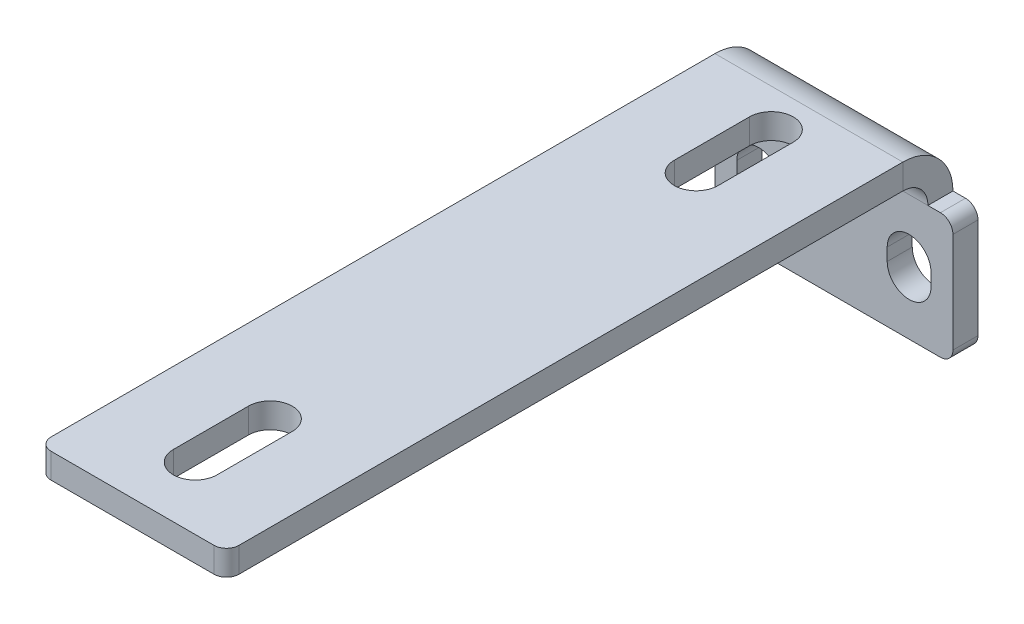
ISO-10303-21;
HEADER;
FILE_DESCRIPTION(('STEP AP214'),'2;1');
FILE_NAME('part.step','',(''),(''),'','','');
FILE_SCHEMA(('AUTOMOTIVE_DESIGN { 1 0 10303 214 1 1 1 1 }'));
ENDSEC;
DATA;
#1=APPLICATION_CONTEXT('core data for automotive mechanical design processes');
#2=APPLICATION_PROTOCOL_DEFINITION('international standard','automotive_design',2000,#1);
#3=PRODUCT_CONTEXT('',#1,'mechanical');
#4=PRODUCT('Part','Part','',(#3));
#5=PRODUCT_RELATED_PRODUCT_CATEGORY('part','',(#4));
#6=PRODUCT_DEFINITION_FORMATION('','',#4);
#7=PRODUCT_DEFINITION_CONTEXT('part definition',#1,'design');
#8=PRODUCT_DEFINITION('design','',#6,#7);
#9=PRODUCT_DEFINITION_SHAPE('','',#8);
#10=(LENGTH_UNIT() NAMED_UNIT(*) SI_UNIT(.MILLI.,.METRE.));
#11=(NAMED_UNIT(*) PLANE_ANGLE_UNIT() SI_UNIT($,.RADIAN.));
#12=(NAMED_UNIT(*) SI_UNIT($,.STERADIAN.) SOLID_ANGLE_UNIT());
#13=UNCERTAINTY_MEASURE_WITH_UNIT(LENGTH_MEASURE(1.E-05),#10,'distance_accuracy_value','');
#14=(GEOMETRIC_REPRESENTATION_CONTEXT(3) GLOBAL_UNCERTAINTY_ASSIGNED_CONTEXT((#13)) GLOBAL_UNIT_ASSIGNED_CONTEXT((#10,
#11,#12)) REPRESENTATION_CONTEXT('',''));
#15=CARTESIAN_POINT('',(0.,0.,0.));
#16=DIRECTION('',(0.,0.,1.));
#17=DIRECTION('',(1.,0.,0.));
#18=AXIS2_PLACEMENT_3D('',#15,#16,#17);
#19=CARTESIAN_POINT('',(0.,0.,-2.));
#20=DIRECTION('',(0.,1.,0.));
#21=DIRECTION('',(-1.,0.,0.));
#22=AXIS2_PLACEMENT_3D('',#19,#20,#21);
#23=PLANE('',#22);
#24=DIRECTION('',(-1.,0.,0.));
#25=VECTOR('',#24,1.);
#26=CARTESIAN_POINT('',(0.,0.,-2.));
#27=LINE('',#26,#25);
#28=CARTESIAN_POINT('',(2.,0.,-2.));
#29=VERTEX_POINT('',#28);
#30=CARTESIAN_POINT('',(1.,0.,-2.));
#31=VERTEX_POINT('',#30);
#32=EDGE_CURVE('E466',#29,#31,#27,.T.);
#33=ORIENTED_EDGE('',*,*,#32,.T.);
#34=DIRECTION('',(0.,0.,1.));
#35=VECTOR('',#34,1.);
#36=CARTESIAN_POINT('',(1.,0.,-2.));
#37=LINE('',#36,#35);
#38=CARTESIAN_POINT('',(1.,0.,0.));
#39=VERTEX_POINT('',#38);
#40=EDGE_CURVE('E469',#31,#39,#37,.T.);
#41=ORIENTED_EDGE('',*,*,#40,.T.);
#42=DIRECTION('',(-1.,0.,0.));
#43=VECTOR('',#42,1.);
#44=CARTESIAN_POINT('',(0.,0.,0.));
#45=LINE('',#44,#43);
#46=CARTESIAN_POINT('',(2.,0.,0.));
#47=VERTEX_POINT('',#46);
#48=EDGE_CURVE('E478',#47,#39,#45,.T.);
#49=ORIENTED_EDGE('',*,*,#48,.F.);
#50=DIRECTION('',(0.,0.,-1.));
#51=VECTOR('',#50,1.);
#52=CARTESIAN_POINT('',(2.,0.,0.));
#53=LINE('',#52,#51);
#54=EDGE_CURVE('E376',#47,#29,#53,.T.);
#55=ORIENTED_EDGE('',*,*,#54,.T.);
#56=EDGE_LOOP('',(#33,#41,#49,#55));
#57=FACE_BOUND('',#56,.T.);
#58=ADVANCED_FACE('F58',(#57),#23,.T.);
#59=CARTESIAN_POINT('',(0.,0.,-2.));
#60=DIRECTION('',(-1.,0.,0.));
#61=DIRECTION('',(0.,0.,1.));
#62=AXIS2_PLACEMENT_3D('',#59,#60,#61);
#63=PLANE('',#62);
#64=DIRECTION('',(0.,-1.,0.));
#65=VECTOR('',#64,1.);
#66=CARTESIAN_POINT('',(0.,0.,0.));
#67=LINE('',#66,#65);
#68=CARTESIAN_POINT('',(0.,-1.,0.));
#69=VERTEX_POINT('',#68);
#70=CARTESIAN_POINT('',(0.,-9.,0.));
#71=VERTEX_POINT('',#70);
#72=EDGE_CURVE('E449',#69,#71,#67,.T.);
#73=ORIENTED_EDGE('',*,*,#72,.F.);
#74=DIRECTION('',(0.,0.,1.));
#75=VECTOR('',#74,1.);
#76=CARTESIAN_POINT('',(0.,-1.,-2.));
#77=LINE('',#76,#75);
#78=CARTESIAN_POINT('',(0.,-1.,-2.));
#79=VERTEX_POINT('',#78);
#80=EDGE_CURVE('E493',#69,#79,#77,.F.);
#81=ORIENTED_EDGE('',*,*,#80,.T.);
#82=DIRECTION('',(0.,-1.,0.));
#83=VECTOR('',#82,1.);
#84=CARTESIAN_POINT('',(0.,0.,-2.));
#85=LINE('',#84,#83);
#86=CARTESIAN_POINT('',(0.,-9.,-2.));
#87=VERTEX_POINT('',#86);
#88=EDGE_CURVE('E456',#79,#87,#85,.T.);
#89=ORIENTED_EDGE('',*,*,#88,.T.);
#90=DIRECTION('',(0.,0.,1.));
#91=VECTOR('',#90,1.);
#92=CARTESIAN_POINT('',(0.,-9.,-2.));
#93=LINE('',#92,#91);
#94=EDGE_CURVE('E490',#87,#71,#93,.T.);
#95=ORIENTED_EDGE('',*,*,#94,.T.);
#96=EDGE_LOOP('',(#73,#81,#89,#95));
#97=FACE_BOUND('',#96,.T.);
#98=ADVANCED_FACE('F541',(#97),#63,.T.);
#99=CARTESIAN_POINT('',(18.,0.,0.));
#100=VERTEX_POINT('',#99);
#101=CARTESIAN_POINT('',(17.,0.,0.));
#102=VERTEX_POINT('',#101);
#103=EDGE_CURVE('E460',#100,#102,#45,.T.);
#104=ORIENTED_EDGE('',*,*,#103,.F.);
#105=DIRECTION('',(0.,0.,1.));
#106=VECTOR('',#105,1.);
#107=CARTESIAN_POINT('',(18.,0.,-2.));
#108=LINE('',#107,#106);
#109=CARTESIAN_POINT('',(18.,0.,-2.));
#110=VERTEX_POINT('',#109);
#111=EDGE_CURVE('E508',#100,#110,#108,.F.);
#112=ORIENTED_EDGE('',*,*,#111,.T.);
#113=CARTESIAN_POINT('',(17.,0.,-2.));
#114=VERTEX_POINT('',#113);
#115=EDGE_CURVE('E467',#110,#114,#27,.T.);
#116=ORIENTED_EDGE('',*,*,#115,.T.);
#117=DIRECTION('',(0.,0.,-1.));
#118=VECTOR('',#117,1.);
#119=CARTESIAN_POINT('',(17.,0.,0.));
#120=LINE('',#119,#118);
#121=EDGE_CURVE('E386',#102,#114,#120,.T.);
#122=ORIENTED_EDGE('',*,*,#121,.F.);
#123=EDGE_LOOP('',(#104,#112,#116,#122));
#124=FACE_BOUND('',#123,.T.);
#125=ADVANCED_FACE('F605',(#124),#23,.T.);
#126=CARTESIAN_POINT('',(19.,0.,-2.));
#127=DIRECTION('',(1.,0.,0.));
#128=DIRECTION('',(0.,0.,-1.));
#129=AXIS2_PLACEMENT_3D('',#126,#127,#128);
#130=PLANE('',#129);
#131=DIRECTION('',(0.,1.,0.));
#132=VECTOR('',#131,1.);
#133=CARTESIAN_POINT('',(19.,0.,-2.));
#134=LINE('',#133,#132);
#135=CARTESIAN_POINT('',(19.,-9.,-2.));
#136=VERTEX_POINT('',#135);
#137=CARTESIAN_POINT('',(19.,-1.,-2.));
#138=VERTEX_POINT('',#137);
#139=EDGE_CURVE('E463',#136,#138,#134,.T.);
#140=ORIENTED_EDGE('',*,*,#139,.T.);
#141=DIRECTION('',(0.,0.,1.));
#142=VECTOR('',#141,1.);
#143=CARTESIAN_POINT('',(19.,-1.,-2.));
#144=LINE('',#143,#142);
#145=CARTESIAN_POINT('',(19.,-1.,0.));
#146=VERTEX_POINT('',#145);
#147=EDGE_CURVE('E505',#138,#146,#144,.T.);
#148=ORIENTED_EDGE('',*,*,#147,.T.);
#149=DIRECTION('',(0.,1.,0.));
#150=VECTOR('',#149,1.);
#151=CARTESIAN_POINT('',(19.,0.,0.));
#152=LINE('',#151,#150);
#153=CARTESIAN_POINT('',(19.,-9.,0.));
#154=VERTEX_POINT('',#153);
#155=EDGE_CURVE('E475',#154,#146,#152,.T.);
#156=ORIENTED_EDGE('',*,*,#155,.F.);
#157=DIRECTION('',(0.,0.,1.));
#158=VECTOR('',#157,1.);
#159=CARTESIAN_POINT('',(19.,-9.,-2.));
#160=LINE('',#159,#158);
#161=EDGE_CURVE('E503',#154,#136,#160,.F.);
#162=ORIENTED_EDGE('',*,*,#161,.T.);
#163=EDGE_LOOP('',(#140,#148,#156,#162));
#164=FACE_BOUND('',#163,.T.);
#165=ADVANCED_FACE('F613',(#164),#130,.T.);
#166=CARTESIAN_POINT('',(0.,-10.,-2.));
#167=DIRECTION('',(0.,-1.,0.));
#168=DIRECTION('',(1.,0.,0.));
#169=AXIS2_PLACEMENT_3D('',#166,#167,#168);
#170=PLANE('',#169);
#171=DIRECTION('',(1.,0.,0.));
#172=VECTOR('',#171,1.);
#173=CARTESIAN_POINT('',(0.,-10.,-2.));
#174=LINE('',#173,#172);
#175=CARTESIAN_POINT('',(1.,-10.,-2.));
#176=VERTEX_POINT('',#175);
#177=CARTESIAN_POINT('',(18.,-10.,-2.));
#178=VERTEX_POINT('',#177);
#179=EDGE_CURVE('E459',#176,#178,#174,.T.);
#180=ORIENTED_EDGE('',*,*,#179,.T.);
#181=DIRECTION('',(0.,0.,1.));
#182=VECTOR('',#181,1.);
#183=CARTESIAN_POINT('',(18.,-10.,-2.));
#184=LINE('',#183,#182);
#185=CARTESIAN_POINT('',(18.,-10.,0.));
#186=VERTEX_POINT('',#185);
#187=EDGE_CURVE('E13',#178,#186,#184,.T.);
#188=ORIENTED_EDGE('',*,*,#187,.T.);
#189=DIRECTION('',(1.,0.,0.));
#190=VECTOR('',#189,1.);
#191=CARTESIAN_POINT('',(0.,-10.,0.));
#192=LINE('',#191,#190);
#193=CARTESIAN_POINT('',(1.,-10.,0.));
#194=VERTEX_POINT('',#193);
#195=EDGE_CURVE('E472',#194,#186,#192,.T.);
#196=ORIENTED_EDGE('',*,*,#195,.F.);
#197=DIRECTION('',(0.,0.,1.));
#198=VECTOR('',#197,1.);
#199=CARTESIAN_POINT('',(1.,-10.,-2.));
#200=LINE('',#199,#198);
#201=EDGE_CURVE('E66',#194,#176,#200,.F.);
#202=ORIENTED_EDGE('',*,*,#201,.T.);
#203=EDGE_LOOP('',(#180,#188,#196,#202));
#204=FACE_BOUND('',#203,.T.);
#205=ADVANCED_FACE('F529',(#204),#170,.T.);
#206=CARTESIAN_POINT('',(0.,0.,-2.));
#207=DIRECTION('',(0.,0.,1.));
#208=DIRECTION('',(1.,0.,0.));
#209=AXIS2_PLACEMENT_3D('',#206,#207,#208);
#210=PLANE('',#209);
#211=DIRECTION('',(0.,1.,0.));
#212=VECTOR('',#211,1.);
#213=CARTESIAN_POINT('',(17.25,-4.5,-2.));
#214=LINE('',#213,#212);
#215=CARTESIAN_POINT('',(17.25,-5.5,-2.));
#216=VERTEX_POINT('',#215);
#217=CARTESIAN_POINT('',(17.25,-4.5,-2.));
#218=VERTEX_POINT('',#217);
#219=EDGE_CURVE('E402',#216,#218,#214,.T.);
#220=ORIENTED_EDGE('',*,*,#219,.T.);
#221=CARTESIAN_POINT('',(15.5,-4.5,-2.));
#222=DIRECTION('',(0.,0.,1.));
#223=DIRECTION('',(1.,0.,0.));
#224=AXIS2_PLACEMENT_3D('',#221,#222,#223);
#225=CIRCLE('',#224,1.75);
#226=CARTESIAN_POINT('',(13.75,-4.5,-2.));
#227=VERTEX_POINT('',#226);
#228=EDGE_CURVE('E392',#218,#227,#225,.T.);
#229=ORIENTED_EDGE('',*,*,#228,.T.);
#230=DIRECTION('',(0.,-1.,0.));
#231=VECTOR('',#230,1.);
#232=CARTESIAN_POINT('',(13.75,-4.5,-2.));
#233=LINE('',#232,#231);
#234=CARTESIAN_POINT('',(13.75,-5.5,-2.));
#235=VERTEX_POINT('',#234);
#236=EDGE_CURVE('E395',#227,#235,#233,.T.);
#237=ORIENTED_EDGE('',*,*,#236,.T.);
#238=CARTESIAN_POINT('',(15.5,-5.5,-2.));
#239=DIRECTION('',(0.,0.,1.));
#240=DIRECTION('',(1.,0.,0.));
#241=AXIS2_PLACEMENT_3D('',#238,#239,#240);
#242=CIRCLE('',#241,1.75);
#243=EDGE_CURVE('E399',#235,#216,#242,.T.);
#244=ORIENTED_EDGE('',*,*,#243,.T.);
#245=EDGE_LOOP('',(#220,#229,#237,#244));
#246=FACE_BOUND('',#245,.T.);
#247=DIRECTION('',(0.,1.,0.));
#248=VECTOR('',#247,1.);
#249=CARTESIAN_POINT('',(5.25,-4.5,-2.));
#250=LINE('',#249,#248);
#251=CARTESIAN_POINT('',(5.25,-5.5,-2.));
#252=VERTEX_POINT('',#251);
#253=CARTESIAN_POINT('',(5.25,-4.5,-2.));
#254=VERTEX_POINT('',#253);
#255=EDGE_CURVE('E434',#252,#254,#250,.T.);
#256=ORIENTED_EDGE('',*,*,#255,.T.);
#257=CARTESIAN_POINT('',(3.5,-4.5,-2.));
#258=DIRECTION('',(0.,0.,1.));
#259=DIRECTION('',(1.,0.,0.));
#260=AXIS2_PLACEMENT_3D('',#257,#258,#259);
#261=CIRCLE('',#260,1.75);
#262=CARTESIAN_POINT('',(1.75,-4.5,-2.));
#263=VERTEX_POINT('',#262);
#264=EDGE_CURVE('E424',#254,#263,#261,.T.);
#265=ORIENTED_EDGE('',*,*,#264,.T.);
#266=DIRECTION('',(0.,-1.,0.));
#267=VECTOR('',#266,1.);
#268=CARTESIAN_POINT('',(1.75,-4.5,-2.));
#269=LINE('',#268,#267);
#270=CARTESIAN_POINT('',(1.75,-5.5,-2.));
#271=VERTEX_POINT('',#270);
#272=EDGE_CURVE('E427',#263,#271,#269,.T.);
#273=ORIENTED_EDGE('',*,*,#272,.T.);
#274=CARTESIAN_POINT('',(3.5,-5.5,-2.));
#275=DIRECTION('',(0.,0.,1.));
#276=DIRECTION('',(1.,0.,0.));
#277=AXIS2_PLACEMENT_3D('',#274,#275,#276);
#278=CIRCLE('',#277,1.75);
#279=EDGE_CURVE('E431',#271,#252,#278,.T.);
#280=ORIENTED_EDGE('',*,*,#279,.T.);
#281=EDGE_LOOP('',(#256,#265,#273,#280));
#282=FACE_BOUND('',#281,.T.);
#283=ORIENTED_EDGE('',*,*,#88,.F.);
#284=CARTESIAN_POINT('',(1.,-1.,-2.));
#285=DIRECTION('',(0.,0.,1.));
#286=DIRECTION('',(1.,0.,0.));
#287=AXIS2_PLACEMENT_3D('',#284,#285,#286);
#288=CIRCLE('',#287,1.);
#289=EDGE_CURVE('E501',#79,#31,#288,.F.);
#290=ORIENTED_EDGE('',*,*,#289,.T.);
#291=ORIENTED_EDGE('',*,*,#32,.F.);
#292=DIRECTION('',(-1.,0.,0.));
#293=VECTOR('',#292,1.);
#294=CARTESIAN_POINT('',(2.,0.,-2.));
#295=LINE('',#294,#293);
#296=EDGE_CURVE('E369',#29,#114,#295,.F.);
#297=ORIENTED_EDGE('',*,*,#296,.T.);
#298=ORIENTED_EDGE('',*,*,#115,.F.);
#299=CARTESIAN_POINT('',(18.,-1.,-2.));
#300=DIRECTION('',(0.,0.,1.));
#301=DIRECTION('',(1.,0.,0.));
#302=AXIS2_PLACEMENT_3D('',#299,#300,#301);
#303=CIRCLE('',#302,1.);
#304=EDGE_CURVE('E499',#110,#138,#303,.F.);
#305=ORIENTED_EDGE('',*,*,#304,.T.);
#306=ORIENTED_EDGE('',*,*,#139,.F.);
#307=CARTESIAN_POINT('',(18.,-9.,-2.));
#308=DIRECTION('',(0.,0.,1.));
#309=DIRECTION('',(1.,0.,0.));
#310=AXIS2_PLACEMENT_3D('',#307,#308,#309);
#311=CIRCLE('',#310,1.);
#312=EDGE_CURVE('E497',#136,#178,#311,.F.);
#313=ORIENTED_EDGE('',*,*,#312,.T.);
#314=ORIENTED_EDGE('',*,*,#179,.F.);
#315=CARTESIAN_POINT('',(1.,-9.,-2.));
#316=DIRECTION('',(0.,0.,1.));
#317=DIRECTION('',(1.,0.,0.));
#318=AXIS2_PLACEMENT_3D('',#315,#316,#317);
#319=CIRCLE('',#318,1.);
#320=EDGE_CURVE('E495',#176,#87,#319,.F.);
#321=ORIENTED_EDGE('',*,*,#320,.T.);
#322=EDGE_LOOP('',(#283,#290,#291,#297,#298,#305,#306,#313,#314,#321));
#323=FACE_BOUND('',#322,.T.);
#324=ADVANCED_FACE('F535',(#246,#282,#323),#210,.F.);
#325=CARTESIAN_POINT('',(0.,0.,0.));
#326=DIRECTION('',(0.,0.,1.));
#327=DIRECTION('',(1.,0.,0.));
#328=AXIS2_PLACEMENT_3D('',#325,#326,#327);
#329=PLANE('',#328);
#330=CARTESIAN_POINT('',(15.5,-4.5,0.));
#331=DIRECTION('',(0.,0.,1.));
#332=DIRECTION('',(1.,0.,0.));
#333=AXIS2_PLACEMENT_3D('',#330,#331,#332);
#334=CIRCLE('',#333,1.75);
#335=CARTESIAN_POINT('',(17.25,-4.5,0.));
#336=VERTEX_POINT('',#335);
#337=CARTESIAN_POINT('',(13.75,-4.5,0.));
#338=VERTEX_POINT('',#337);
#339=EDGE_CURVE('E389',#336,#338,#334,.T.);
#340=ORIENTED_EDGE('',*,*,#339,.F.);
#341=DIRECTION('',(0.,1.,0.));
#342=VECTOR('',#341,1.);
#343=CARTESIAN_POINT('',(17.25,-4.5,0.));
#344=LINE('',#343,#342);
#345=CARTESIAN_POINT('',(17.25,-5.5,0.));
#346=VERTEX_POINT('',#345);
#347=EDGE_CURVE('E396',#346,#336,#344,.T.);
#348=ORIENTED_EDGE('',*,*,#347,.F.);
#349=CARTESIAN_POINT('',(15.5,-5.5,0.));
#350=DIRECTION('',(0.,0.,1.));
#351=DIRECTION('',(1.,0.,0.));
#352=AXIS2_PLACEMENT_3D('',#349,#350,#351);
#353=CIRCLE('',#352,1.75);
#354=CARTESIAN_POINT('',(13.75,-5.5,0.));
#355=VERTEX_POINT('',#354);
#356=EDGE_CURVE('E410',#355,#346,#353,.T.);
#357=ORIENTED_EDGE('',*,*,#356,.F.);
#358=DIRECTION('',(0.,-1.,0.));
#359=VECTOR('',#358,1.);
#360=CARTESIAN_POINT('',(13.75,-4.5,0.));
#361=LINE('',#360,#359);
#362=EDGE_CURVE('E407',#338,#355,#361,.T.);
#363=ORIENTED_EDGE('',*,*,#362,.F.);
#364=EDGE_LOOP('',(#340,#348,#357,#363));
#365=FACE_BOUND('',#364,.T.);
#366=CARTESIAN_POINT('',(3.5,-4.5,0.));
#367=DIRECTION('',(0.,0.,1.));
#368=DIRECTION('',(1.,0.,0.));
#369=AXIS2_PLACEMENT_3D('',#366,#367,#368);
#370=CIRCLE('',#369,1.75);
#371=CARTESIAN_POINT('',(5.25,-4.5,0.));
#372=VERTEX_POINT('',#371);
#373=CARTESIAN_POINT('',(1.75,-4.5,0.));
#374=VERTEX_POINT('',#373);
#375=EDGE_CURVE('E417',#372,#374,#370,.T.);
#376=ORIENTED_EDGE('',*,*,#375,.F.);
#377=DIRECTION('',(0.,1.,0.));
#378=VECTOR('',#377,1.);
#379=CARTESIAN_POINT('',(5.25,-4.5,0.));
#380=LINE('',#379,#378);
#381=CARTESIAN_POINT('',(5.25,-5.5,0.));
#382=VERTEX_POINT('',#381);
#383=EDGE_CURVE('E428',#382,#372,#380,.T.);
#384=ORIENTED_EDGE('',*,*,#383,.F.);
#385=CARTESIAN_POINT('',(3.5,-5.5,0.));
#386=DIRECTION('',(0.,0.,1.));
#387=DIRECTION('',(1.,0.,0.));
#388=AXIS2_PLACEMENT_3D('',#385,#386,#387);
#389=CIRCLE('',#388,1.75);
#390=CARTESIAN_POINT('',(1.75,-5.5,0.));
#391=VERTEX_POINT('',#390);
#392=EDGE_CURVE('E442',#391,#382,#389,.T.);
#393=ORIENTED_EDGE('',*,*,#392,.F.);
#394=DIRECTION('',(0.,-1.,0.));
#395=VECTOR('',#394,1.);
#396=CARTESIAN_POINT('',(1.75,-4.5,0.));
#397=LINE('',#396,#395);
#398=EDGE_CURVE('E439',#374,#391,#397,.T.);
#399=ORIENTED_EDGE('',*,*,#398,.F.);
#400=EDGE_LOOP('',(#376,#384,#393,#399));
#401=FACE_BOUND('',#400,.T.);
#402=ORIENTED_EDGE('',*,*,#48,.T.);
#403=CARTESIAN_POINT('',(1.,-1.,0.));
#404=DIRECTION('',(0.,0.,1.));
#405=DIRECTION('',(1.,0.,0.));
#406=AXIS2_PLACEMENT_3D('',#403,#404,#405);
#407=CIRCLE('',#406,1.);
#408=EDGE_CURVE('E488',#39,#69,#407,.T.);
#409=ORIENTED_EDGE('',*,*,#408,.T.);
#410=ORIENTED_EDGE('',*,*,#72,.T.);
#411=CARTESIAN_POINT('',(1.,-9.,0.));
#412=DIRECTION('',(0.,0.,1.));
#413=DIRECTION('',(1.,0.,0.));
#414=AXIS2_PLACEMENT_3D('',#411,#412,#413);
#415=CIRCLE('',#414,1.);
#416=EDGE_CURVE('E482',#71,#194,#415,.T.);
#417=ORIENTED_EDGE('',*,*,#416,.T.);
#418=ORIENTED_EDGE('',*,*,#195,.T.);
#419=CARTESIAN_POINT('',(18.,-9.,0.));
#420=DIRECTION('',(0.,0.,1.));
#421=DIRECTION('',(1.,0.,0.));
#422=AXIS2_PLACEMENT_3D('',#419,#420,#421);
#423=CIRCLE('',#422,1.);
#424=EDGE_CURVE('E484',#186,#154,#423,.T.);
#425=ORIENTED_EDGE('',*,*,#424,.T.);
#426=ORIENTED_EDGE('',*,*,#155,.T.);
#427=CARTESIAN_POINT('',(18.,-1.,0.));
#428=DIRECTION('',(0.,0.,1.));
#429=DIRECTION('',(1.,0.,0.));
#430=AXIS2_PLACEMENT_3D('',#427,#428,#429);
#431=CIRCLE('',#430,1.);
#432=EDGE_CURVE('E486',#146,#100,#431,.T.);
#433=ORIENTED_EDGE('',*,*,#432,.T.);
#434=ORIENTED_EDGE('',*,*,#103,.T.);
#435=DIRECTION('',(-1.,0.,0.));
#436=VECTOR('',#435,1.);
#437=CARTESIAN_POINT('',(2.,0.,0.));
#438=LINE('',#437,#436);
#439=EDGE_CURVE('E381',#47,#102,#438,.F.);
#440=ORIENTED_EDGE('',*,*,#439,.F.);
#441=EDGE_LOOP('',(#402,#409,#410,#417,#418,#425,#426,#433,#434,#440));
#442=FACE_BOUND('',#441,.T.);
#443=ADVANCED_FACE('F545',(#365,#401,#442),#329,.T.);
#444=CARTESIAN_POINT('',(3.5,-4.5,-2.));
#445=DIRECTION('',(0.,0.,1.));
#446=DIRECTION('',(1.,0.,0.));
#447=AXIS2_PLACEMENT_3D('',#444,#445,#446);
#448=CYLINDRICAL_SURFACE('',#447,1.75);
#449=ORIENTED_EDGE('',*,*,#375,.T.);
#450=DIRECTION('',(0.,0.,1.));
#451=VECTOR('',#450,1.);
#452=CARTESIAN_POINT('',(1.75,-4.5,-2.));
#453=LINE('',#452,#451);
#454=EDGE_CURVE('E437',#263,#374,#453,.T.);
#455=ORIENTED_EDGE('',*,*,#454,.F.);
#456=ORIENTED_EDGE('',*,*,#264,.F.);
#457=DIRECTION('',(0.,0.,1.));
#458=VECTOR('',#457,1.);
#459=CARTESIAN_POINT('',(5.25,-4.5,-2.));
#460=LINE('',#459,#458);
#461=EDGE_CURVE('E447',#254,#372,#460,.T.);
#462=ORIENTED_EDGE('',*,*,#461,.T.);
#463=EDGE_LOOP('',(#449,#455,#456,#462));
#464=FACE_BOUND('',#463,.T.);
#465=ADVANCED_FACE('F641',(#464),#448,.F.);
#466=CARTESIAN_POINT('',(5.25,-4.5,-2.));
#467=DIRECTION('',(1.,0.,0.));
#468=DIRECTION('',(0.,0.,-1.));
#469=AXIS2_PLACEMENT_3D('',#466,#467,#468);
#470=PLANE('',#469);
#471=ORIENTED_EDGE('',*,*,#383,.T.);
#472=ORIENTED_EDGE('',*,*,#461,.F.);
#473=ORIENTED_EDGE('',*,*,#255,.F.);
#474=DIRECTION('',(0.,0.,1.));
#475=VECTOR('',#474,1.);
#476=CARTESIAN_POINT('',(5.25,-5.5,-2.));
#477=LINE('',#476,#475);
#478=EDGE_CURVE('E450',#252,#382,#477,.T.);
#479=ORIENTED_EDGE('',*,*,#478,.T.);
#480=EDGE_LOOP('',(#471,#472,#473,#479));
#481=FACE_BOUND('',#480,.T.);
#482=ADVANCED_FACE('F647',(#481),#470,.F.);
#483=CARTESIAN_POINT('',(3.5,-5.5,-2.));
#484=DIRECTION('',(0.,0.,1.));
#485=DIRECTION('',(1.,0.,0.));
#486=AXIS2_PLACEMENT_3D('',#483,#484,#485);
#487=CYLINDRICAL_SURFACE('',#486,1.75);
#488=ORIENTED_EDGE('',*,*,#392,.T.);
#489=ORIENTED_EDGE('',*,*,#478,.F.);
#490=ORIENTED_EDGE('',*,*,#279,.F.);
#491=DIRECTION('',(0.,0.,1.));
#492=VECTOR('',#491,1.);
#493=CARTESIAN_POINT('',(1.75,-5.5,-2.));
#494=LINE('',#493,#492);
#495=EDGE_CURVE('E452',#271,#391,#494,.T.);
#496=ORIENTED_EDGE('',*,*,#495,.T.);
#497=EDGE_LOOP('',(#488,#489,#490,#496));
#498=FACE_BOUND('',#497,.T.);
#499=ADVANCED_FACE('F653',(#498),#487,.F.);
#500=CARTESIAN_POINT('',(1.75,-4.5,-2.));
#501=DIRECTION('',(-1.,0.,0.));
#502=DIRECTION('',(0.,0.,1.));
#503=AXIS2_PLACEMENT_3D('',#500,#501,#502);
#504=PLANE('',#503);
#505=ORIENTED_EDGE('',*,*,#398,.T.);
#506=ORIENTED_EDGE('',*,*,#495,.F.);
#507=ORIENTED_EDGE('',*,*,#272,.F.);
#508=ORIENTED_EDGE('',*,*,#454,.T.);
#509=EDGE_LOOP('',(#505,#506,#507,#508));
#510=FACE_BOUND('',#509,.T.);
#511=ADVANCED_FACE('F649',(#510),#504,.F.);
#512=CARTESIAN_POINT('',(15.5,-4.5,-2.));
#513=DIRECTION('',(0.,0.,1.));
#514=DIRECTION('',(1.,0.,0.));
#515=AXIS2_PLACEMENT_3D('',#512,#513,#514);
#516=CYLINDRICAL_SURFACE('',#515,1.75);
#517=ORIENTED_EDGE('',*,*,#339,.T.);
#518=DIRECTION('',(0.,0.,1.));
#519=VECTOR('',#518,1.);
#520=CARTESIAN_POINT('',(13.75,-4.5,-2.));
#521=LINE('',#520,#519);
#522=EDGE_CURVE('E405',#227,#338,#521,.T.);
#523=ORIENTED_EDGE('',*,*,#522,.F.);
#524=ORIENTED_EDGE('',*,*,#228,.F.);
#525=DIRECTION('',(0.,0.,1.));
#526=VECTOR('',#525,1.);
#527=CARTESIAN_POINT('',(17.25,-4.5,-2.));
#528=LINE('',#527,#526);
#529=EDGE_CURVE('E415',#218,#336,#528,.T.);
#530=ORIENTED_EDGE('',*,*,#529,.T.);
#531=EDGE_LOOP('',(#517,#523,#524,#530));
#532=FACE_BOUND('',#531,.T.);
#533=ADVANCED_FACE('F652',(#532),#516,.F.);
#534=CARTESIAN_POINT('',(17.25,-4.5,-2.));
#535=DIRECTION('',(1.,0.,0.));
#536=DIRECTION('',(0.,0.,-1.));
#537=AXIS2_PLACEMENT_3D('',#534,#535,#536);
#538=PLANE('',#537);
#539=ORIENTED_EDGE('',*,*,#347,.T.);
#540=ORIENTED_EDGE('',*,*,#529,.F.);
#541=ORIENTED_EDGE('',*,*,#219,.F.);
#542=DIRECTION('',(0.,0.,1.));
#543=VECTOR('',#542,1.);
#544=CARTESIAN_POINT('',(17.25,-5.5,-2.));
#545=LINE('',#544,#543);
#546=EDGE_CURVE('E418',#216,#346,#545,.T.);
#547=ORIENTED_EDGE('',*,*,#546,.T.);
#548=EDGE_LOOP('',(#539,#540,#541,#547));
#549=FACE_BOUND('',#548,.T.);
#550=ADVANCED_FACE('F663',(#549),#538,.F.);
#551=CARTESIAN_POINT('',(15.5,-5.5,-2.));
#552=DIRECTION('',(0.,0.,1.));
#553=DIRECTION('',(1.,0.,0.));
#554=AXIS2_PLACEMENT_3D('',#551,#552,#553);
#555=CYLINDRICAL_SURFACE('',#554,1.75);
#556=ORIENTED_EDGE('',*,*,#356,.T.);
#557=ORIENTED_EDGE('',*,*,#546,.F.);
#558=ORIENTED_EDGE('',*,*,#243,.F.);
#559=DIRECTION('',(0.,0.,1.));
#560=VECTOR('',#559,1.);
#561=CARTESIAN_POINT('',(13.75,-5.5,-2.));
#562=LINE('',#561,#560);
#563=EDGE_CURVE('E420',#235,#355,#562,.T.);
#564=ORIENTED_EDGE('',*,*,#563,.T.);
#565=EDGE_LOOP('',(#556,#557,#558,#564));
#566=FACE_BOUND('',#565,.T.);
#567=ADVANCED_FACE('F668',(#566),#555,.F.);
#568=CARTESIAN_POINT('',(13.75,-4.5,-2.));
#569=DIRECTION('',(-1.,0.,0.));
#570=DIRECTION('',(0.,0.,1.));
#571=AXIS2_PLACEMENT_3D('',#568,#569,#570);
#572=PLANE('',#571);
#573=ORIENTED_EDGE('',*,*,#362,.T.);
#574=ORIENTED_EDGE('',*,*,#563,.F.);
#575=ORIENTED_EDGE('',*,*,#236,.F.);
#576=ORIENTED_EDGE('',*,*,#522,.T.);
#577=EDGE_LOOP('',(#573,#574,#575,#576));
#578=FACE_BOUND('',#577,.T.);
#579=ADVANCED_FACE('F665',(#578),#572,.F.);
#580=CARTESIAN_POINT('',(17.,0.,2.));
#581=DIRECTION('',(1.,0.,0.));
#582=DIRECTION('',(0.,1.,0.));
#583=AXIS2_PLACEMENT_3D('',#580,#581,#582);
#584=PLANE('',#583);
#585=DIRECTION('',(0.,-1.,0.));
#586=VECTOR('',#585,1.);
#587=CARTESIAN_POINT('',(17.,4.,1.99999999999999));
#588=LINE('',#587,#586);
#589=CARTESIAN_POINT('',(17.,2.,1.99999999999999));
#590=VERTEX_POINT('',#589);
#591=CARTESIAN_POINT('',(17.,4.,1.99999999999999));
#592=VERTEX_POINT('',#591);
#593=EDGE_CURVE('E344',#590,#592,#588,.F.);
#594=ORIENTED_EDGE('',*,*,#593,.F.);
#595=CARTESIAN_POINT('',(17.,0.,2.));
#596=DIRECTION('',(-1.,0.,0.));
#597=DIRECTION('',(0.,-1.,0.));
#598=AXIS2_PLACEMENT_3D('',#595,#596,#597);
#599=CIRCLE('',#598,2.);
#600=EDGE_CURVE('E378',#102,#590,#599,.F.);
#601=ORIENTED_EDGE('',*,*,#600,.F.);
#602=ORIENTED_EDGE('',*,*,#121,.T.);
#603=CARTESIAN_POINT('',(17.,0.,2.));
#604=DIRECTION('',(-1.,0.,0.));
#605=DIRECTION('',(0.,-1.,0.));
#606=AXIS2_PLACEMENT_3D('',#603,#604,#605);
#607=CIRCLE('',#606,4.);
#608=EDGE_CURVE('E372',#114,#592,#607,.F.);
#609=ORIENTED_EDGE('',*,*,#608,.T.);
#610=EDGE_LOOP('',(#594,#601,#602,#609));
#611=FACE_BOUND('',#610,.T.);
#612=ADVANCED_FACE('F564',(#611),#584,.T.);
#613=CARTESIAN_POINT('',(2.,0.,2.));
#614=DIRECTION('',(1.,0.,0.));
#615=DIRECTION('',(0.,1.,0.));
#616=AXIS2_PLACEMENT_3D('',#613,#614,#615);
#617=PLANE('',#616);
#618=CARTESIAN_POINT('',(2.,0.,2.));
#619=DIRECTION('',(-1.,0.,0.));
#620=DIRECTION('',(0.,-1.,0.));
#621=AXIS2_PLACEMENT_3D('',#618,#619,#620);
#622=CIRCLE('',#621,2.);
#623=CARTESIAN_POINT('',(2.,2.,1.99999999999999));
#624=VERTEX_POINT('',#623);
#625=EDGE_CURVE('E347',#624,#47,#622,.T.);
#626=ORIENTED_EDGE('',*,*,#625,.F.);
#627=DIRECTION('',(0.,-1.,0.));
#628=VECTOR('',#627,1.);
#629=CARTESIAN_POINT('',(2.,2.,1.99999999999999));
#630=LINE('',#629,#628);
#631=CARTESIAN_POINT('',(2.,4.,1.99999999999999));
#632=VERTEX_POINT('',#631);
#633=EDGE_CURVE('E362',#624,#632,#630,.F.);
#634=ORIENTED_EDGE('',*,*,#633,.T.);
#635=CARTESIAN_POINT('',(2.,0.,2.));
#636=DIRECTION('',(-1.,0.,0.));
#637=DIRECTION('',(0.,-1.,0.));
#638=AXIS2_PLACEMENT_3D('',#635,#636,#637);
#639=CIRCLE('',#638,4.);
#640=EDGE_CURVE('E373',#632,#29,#639,.T.);
#641=ORIENTED_EDGE('',*,*,#640,.T.);
#642=ORIENTED_EDGE('',*,*,#54,.F.);
#643=EDGE_LOOP('',(#626,#634,#641,#642));
#644=FACE_BOUND('',#643,.T.);
#645=ADVANCED_FACE('F580',(#644),#617,.F.);
#646=CARTESIAN_POINT('',(2.,0.,2.));
#647=DIRECTION('',(-1.,0.,0.));
#648=DIRECTION('',(0.,1.,0.));
#649=AXIS2_PLACEMENT_3D('',#646,#647,#648);
#650=CYLINDRICAL_SURFACE('',#649,4.);
#651=ORIENTED_EDGE('',*,*,#296,.F.);
#652=ORIENTED_EDGE('',*,*,#640,.F.);
#653=DIRECTION('',(-1.,0.,0.));
#654=VECTOR('',#653,1.);
#655=CARTESIAN_POINT('',(17.,4.,1.99999999999999));
#656=LINE('',#655,#654);
#657=EDGE_CURVE('E359',#632,#592,#656,.F.);
#658=ORIENTED_EDGE('',*,*,#657,.T.);
#659=ORIENTED_EDGE('',*,*,#608,.F.);
#660=EDGE_LOOP('',(#651,#652,#658,#659));
#661=FACE_BOUND('',#660,.T.);
#662=ADVANCED_FACE('F560',(#661),#650,.T.);
#663=CARTESIAN_POINT('',(2.,0.,2.));
#664=DIRECTION('',(-1.,0.,0.));
#665=DIRECTION('',(0.,1.,0.));
#666=AXIS2_PLACEMENT_3D('',#663,#664,#665);
#667=CYLINDRICAL_SURFACE('',#666,2.);
#668=ORIENTED_EDGE('',*,*,#439,.T.);
#669=ORIENTED_EDGE('',*,*,#600,.T.);
#670=DIRECTION('',(-1.,0.,0.));
#671=VECTOR('',#670,1.);
#672=CARTESIAN_POINT('',(17.,2.,1.99999999999999));
#673=LINE('',#672,#671);
#674=EDGE_CURVE('E365',#590,#624,#673,.T.);
#675=ORIENTED_EDGE('',*,*,#674,.T.);
#676=ORIENTED_EDGE('',*,*,#625,.T.);
#677=EDGE_LOOP('',(#668,#669,#675,#676));
#678=FACE_BOUND('',#677,.T.);
#679=ADVANCED_FACE('F577',(#678),#667,.F.);
#680=CARTESIAN_POINT('',(2.,3.99999999999999,0.));
#681=DIRECTION('',(1.,0.,0.));
#682=DIRECTION('',(0.,1.,0.));
#683=AXIS2_PLACEMENT_3D('',#680,#681,#682);
#684=PLANE('',#683);
#685=DIRECTION('',(0.,0.,-1.));
#686=VECTOR('',#685,1.);
#687=CARTESIAN_POINT('',(2.,1.99999999999999,0.));
#688=LINE('',#687,#686);
#689=CARTESIAN_POINT('',(2.,2.00000000000019,55.));
#690=VERTEX_POINT('',#689);
#691=EDGE_CURVE('E357',#624,#690,#688,.F.);
#692=ORIENTED_EDGE('',*,*,#691,.T.);
#693=DIRECTION('',(0.,-1.,0.));
#694=VECTOR('',#693,1.);
#695=CARTESIAN_POINT('',(2.,4.00000000000018,55.));
#696=LINE('',#695,#694);
#697=CARTESIAN_POINT('',(2.,4.00000000000018,55.));
#698=VERTEX_POINT('',#697);
#699=EDGE_CURVE('E81',#690,#698,#696,.F.);
#700=ORIENTED_EDGE('',*,*,#699,.T.);
#701=DIRECTION('',(0.,0.,1.));
#702=VECTOR('',#701,1.);
#703=CARTESIAN_POINT('',(2.,3.99999999999999,0.));
#704=LINE('',#703,#702);
#705=EDGE_CURVE('E350',#632,#698,#704,.T.);
#706=ORIENTED_EDGE('',*,*,#705,.F.);
#707=ORIENTED_EDGE('',*,*,#633,.F.);
#708=EDGE_LOOP('',(#692,#700,#706,#707));
#709=FACE_BOUND('',#708,.T.);
#710=ADVANCED_FACE('F581',(#709),#684,.F.);
#711=CARTESIAN_POINT('',(17.,3.99999999999999,0.));
#712=DIRECTION('',(-1.,0.,0.));
#713=DIRECTION('',(0.,-1.,0.));
#714=AXIS2_PLACEMENT_3D('',#711,#712,#713);
#715=PLANE('',#714);
#716=DIRECTION('',(0.,0.,-1.));
#717=VECTOR('',#716,1.);
#718=CARTESIAN_POINT('',(17.,3.99999999999999,0.));
#719=LINE('',#718,#717);
#720=CARTESIAN_POINT('',(17.,4.00000000000018,55.));
#721=VERTEX_POINT('',#720);
#722=EDGE_CURVE('E345',#721,#592,#719,.T.);
#723=ORIENTED_EDGE('',*,*,#722,.F.);
#724=DIRECTION('',(0.,-1.,0.));
#725=VECTOR('',#724,1.);
#726=CARTESIAN_POINT('',(17.,4.00000000000018,55.));
#727=LINE('',#726,#725);
#728=CARTESIAN_POINT('',(17.,2.00000000000018,55.));
#729=VERTEX_POINT('',#728);
#730=EDGE_CURVE('E523',#721,#729,#727,.T.);
#731=ORIENTED_EDGE('',*,*,#730,.T.);
#732=DIRECTION('',(0.,0.,1.));
#733=VECTOR('',#732,1.);
#734=CARTESIAN_POINT('',(17.,1.99999999999999,0.));
#735=LINE('',#734,#733);
#736=EDGE_CURVE('E352',#729,#590,#735,.F.);
#737=ORIENTED_EDGE('',*,*,#736,.T.);
#738=ORIENTED_EDGE('',*,*,#593,.T.);
#739=EDGE_LOOP('',(#723,#731,#737,#738));
#740=FACE_BOUND('',#739,.T.);
#741=ADVANCED_FACE('F568',(#740),#715,.F.);
#742=CARTESIAN_POINT('',(0.,3.99999999999999,0.));
#743=DIRECTION('',(0.,-1.,0.));
#744=DIRECTION('',(0.,0.,-1.));
#745=AXIS2_PLACEMENT_3D('',#742,#743,#744);
#746=PLANE('',#745);
#747=DIRECTION('',(0.,0.,-1.));
#748=VECTOR('',#747,1.);
#749=CARTESIAN_POINT('',(11.25,4.00000000000017,51.));
#750=LINE('',#749,#748);
#751=CARTESIAN_POINT('',(11.25,4.00000000000017,51.));
#752=VERTEX_POINT('',#751);
#753=CARTESIAN_POINT('',(11.25,4.00000000000015,45.));
#754=VERTEX_POINT('',#753);
#755=EDGE_CURVE('E297',#752,#754,#750,.T.);
#756=ORIENTED_EDGE('',*,*,#755,.F.);
#757=CARTESIAN_POINT('',(9.50000000000001,4.00000000000017,51.));
#758=DIRECTION('',(0.,1.,0.));
#759=DIRECTION('',(0.,0.,1.));
#760=AXIS2_PLACEMENT_3D('',#757,#758,#759);
#761=CIRCLE('',#760,1.74999999999999);
#762=CARTESIAN_POINT('',(7.75000000000001,4.00000000000017,51.));
#763=VERTEX_POINT('',#762);
#764=EDGE_CURVE('E289',#763,#752,#761,.T.);
#765=ORIENTED_EDGE('',*,*,#764,.F.);
#766=DIRECTION('',(0.,0.,1.));
#767=VECTOR('',#766,1.);
#768=CARTESIAN_POINT('',(7.75000000000001,4.00000000000017,51.));
#769=LINE('',#768,#767);
#770=CARTESIAN_POINT('',(7.75000000000001,4.00000000000015,45.));
#771=VERTEX_POINT('',#770);
#772=EDGE_CURVE('E290',#771,#763,#769,.T.);
#773=ORIENTED_EDGE('',*,*,#772,.F.);
#774=CARTESIAN_POINT('',(9.5,4.00000000000015,45.));
#775=DIRECTION('',(0.,1.,0.));
#776=DIRECTION('',(0.,0.,1.));
#777=AXIS2_PLACEMENT_3D('',#774,#775,#776);
#778=CIRCLE('',#777,1.74999999999999);
#779=EDGE_CURVE('E304',#754,#771,#778,.T.);
#780=ORIENTED_EDGE('',*,*,#779,.F.);
#781=EDGE_LOOP('',(#756,#765,#773,#780));
#782=FACE_BOUND('',#781,.T.);
#783=DIRECTION('',(0.,0.,-1.));
#784=VECTOR('',#783,1.);
#785=CARTESIAN_POINT('',(11.25,4.00000000000003,11.));
#786=LINE('',#785,#784);
#787=CARTESIAN_POINT('',(11.25,4.00000000000003,11.));
#788=VERTEX_POINT('',#787);
#789=CARTESIAN_POINT('',(11.25,4.00000000000001,4.99999999999999));
#790=VERTEX_POINT('',#789);
#791=EDGE_CURVE('E323',#788,#790,#786,.T.);
#792=ORIENTED_EDGE('',*,*,#791,.F.);
#793=CARTESIAN_POINT('',(9.5,4.00000000000003,11.));
#794=DIRECTION('',(0.,1.,0.));
#795=DIRECTION('',(0.,0.,1.));
#796=AXIS2_PLACEMENT_3D('',#793,#794,#795);
#797=CIRCLE('',#796,1.75);
#798=CARTESIAN_POINT('',(7.75000000000001,4.00000000000003,11.));
#799=VERTEX_POINT('',#798);
#800=EDGE_CURVE('E321',#799,#788,#797,.T.);
#801=ORIENTED_EDGE('',*,*,#800,.F.);
#802=DIRECTION('',(0.,0.,1.));
#803=VECTOR('',#802,1.);
#804=CARTESIAN_POINT('',(7.75000000000001,4.00000000000003,11.));
#805=LINE('',#804,#803);
#806=CARTESIAN_POINT('',(7.75,4.00000000000001,4.99999999999999));
#807=VERTEX_POINT('',#806);
#808=EDGE_CURVE('E329',#807,#799,#805,.T.);
#809=ORIENTED_EDGE('',*,*,#808,.F.);
#810=CARTESIAN_POINT('',(9.5,4.00000000000001,4.99999999999999));
#811=DIRECTION('',(0.,1.,0.));
#812=DIRECTION('',(0.,0.,1.));
#813=AXIS2_PLACEMENT_3D('',#810,#811,#812);
#814=CIRCLE('',#813,1.75);
#815=EDGE_CURVE('E326',#790,#807,#814,.T.);
#816=ORIENTED_EDGE('',*,*,#815,.F.);
#817=EDGE_LOOP('',(#792,#801,#809,#816));
#818=FACE_BOUND('',#817,.T.);
#819=ORIENTED_EDGE('',*,*,#705,.T.);
#820=CARTESIAN_POINT('',(3.,4.00000000000018,55.));
#821=DIRECTION('',(0.,-1.,0.));
#822=DIRECTION('',(0.,0.,-1.));
#823=AXIS2_PLACEMENT_3D('',#820,#821,#822);
#824=CIRCLE('',#823,1.);
#825=CARTESIAN_POINT('',(3.,4.00000000000019,56.));
#826=VERTEX_POINT('',#825);
#827=EDGE_CURVE('E521',#698,#826,#824,.F.);
#828=ORIENTED_EDGE('',*,*,#827,.T.);
#829=DIRECTION('',(1.,0.,0.));
#830=VECTOR('',#829,1.);
#831=CARTESIAN_POINT('',(0.,4.00000000000019,56.));
#832=LINE('',#831,#830);
#833=CARTESIAN_POINT('',(16.,4.00000000000019,56.));
#834=VERTEX_POINT('',#833);
#835=EDGE_CURVE('E348',#826,#834,#832,.T.);
#836=ORIENTED_EDGE('',*,*,#835,.T.);
#837=CARTESIAN_POINT('',(16.,4.00000000000018,55.));
#838=DIRECTION('',(0.,-1.,0.));
#839=DIRECTION('',(0.,0.,-1.));
#840=AXIS2_PLACEMENT_3D('',#837,#838,#839);
#841=CIRCLE('',#840,1.);
#842=EDGE_CURVE('E73',#834,#721,#841,.F.);
#843=ORIENTED_EDGE('',*,*,#842,.T.);
#844=ORIENTED_EDGE('',*,*,#722,.T.);
#845=ORIENTED_EDGE('',*,*,#657,.F.);
#846=EDGE_LOOP('',(#819,#828,#836,#843,#844,#845));
#847=FACE_BOUND('',#846,.T.);
#848=ADVANCED_FACE('F583',(#782,#818,#847),#746,.F.);
#849=CARTESIAN_POINT('',(0.,1.99999999999999,0.));
#850=DIRECTION('',(0.,-1.,0.));
#851=DIRECTION('',(0.,0.,-1.));
#852=AXIS2_PLACEMENT_3D('',#849,#850,#851);
#853=PLANE('',#852);
#854=CARTESIAN_POINT('',(9.50000000000001,2.00000000000017,51.));
#855=DIRECTION('',(0.,-1.,0.));
#856=DIRECTION('',(0.,0.,-1.));
#857=AXIS2_PLACEMENT_3D('',#854,#855,#856);
#858=CIRCLE('',#857,1.74999999999999);
#859=CARTESIAN_POINT('',(7.75000000000001,2.00000000000017,51.));
#860=VERTEX_POINT('',#859);
#861=CARTESIAN_POINT('',(11.25,2.00000000000017,51.));
#862=VERTEX_POINT('',#861);
#863=EDGE_CURVE('E286',#860,#862,#858,.F.);
#864=ORIENTED_EDGE('',*,*,#863,.T.);
#865=DIRECTION('',(0.,0.,-1.));
#866=VECTOR('',#865,1.);
#867=CARTESIAN_POINT('',(11.25,2.00000000000017,51.));
#868=LINE('',#867,#866);
#869=CARTESIAN_POINT('',(11.25,2.00000000000015,45.));
#870=VERTEX_POINT('',#869);
#871=EDGE_CURVE('E270',#862,#870,#868,.T.);
#872=ORIENTED_EDGE('',*,*,#871,.T.);
#873=CARTESIAN_POINT('',(9.5,2.00000000000015,45.));
#874=DIRECTION('',(0.,-1.,0.));
#875=DIRECTION('',(0.,0.,-1.));
#876=AXIS2_PLACEMENT_3D('',#873,#874,#875);
#877=CIRCLE('',#876,1.74999999999999);
#878=CARTESIAN_POINT('',(7.75000000000001,2.00000000000015,45.));
#879=VERTEX_POINT('',#878);
#880=EDGE_CURVE('E299',#870,#879,#877,.F.);
#881=ORIENTED_EDGE('',*,*,#880,.T.);
#882=DIRECTION('',(0.,0.,1.));
#883=VECTOR('',#882,1.);
#884=CARTESIAN_POINT('',(7.75000000000001,2.00000000000017,51.));
#885=LINE('',#884,#883);
#886=EDGE_CURVE('E295',#879,#860,#885,.T.);
#887=ORIENTED_EDGE('',*,*,#886,.T.);
#888=EDGE_LOOP('',(#864,#872,#881,#887));
#889=FACE_BOUND('',#888,.T.);
#890=CARTESIAN_POINT('',(9.5,2.00000000000003,11.));
#891=DIRECTION('',(0.,-1.,0.));
#892=DIRECTION('',(0.,0.,-1.));
#893=AXIS2_PLACEMENT_3D('',#890,#891,#892);
#894=CIRCLE('',#893,1.75);
#895=CARTESIAN_POINT('',(7.75000000000001,2.00000000000003,11.));
#896=VERTEX_POINT('',#895);
#897=CARTESIAN_POINT('',(11.25,2.00000000000003,11.));
#898=VERTEX_POINT('',#897);
#899=EDGE_CURVE('E318',#896,#898,#894,.F.);
#900=ORIENTED_EDGE('',*,*,#899,.T.);
#901=DIRECTION('',(0.,0.,-1.));
#902=VECTOR('',#901,1.);
#903=CARTESIAN_POINT('',(11.25,2.00000000000003,11.));
#904=LINE('',#903,#902);
#905=CARTESIAN_POINT('',(11.25,2.00000000000001,4.99999999999999));
#906=VERTEX_POINT('',#905);
#907=EDGE_CURVE('E335',#898,#906,#904,.T.);
#908=ORIENTED_EDGE('',*,*,#907,.T.);
#909=CARTESIAN_POINT('',(9.5,2.00000000000001,5.));
#910=DIRECTION('',(0.,-1.,0.));
#911=DIRECTION('',(0.,0.,-1.));
#912=AXIS2_PLACEMENT_3D('',#909,#910,#911);
#913=CIRCLE('',#912,1.75);
#914=CARTESIAN_POINT('',(7.75,2.00000000000001,5.00000000000002));
#915=VERTEX_POINT('',#914);
#916=EDGE_CURVE('E281',#906,#915,#913,.F.);
#917=ORIENTED_EDGE('',*,*,#916,.T.);
#918=DIRECTION('',(0.,0.,1.));
#919=VECTOR('',#918,1.);
#920=CARTESIAN_POINT('',(7.75000000000001,2.00000000000003,11.));
#921=LINE('',#920,#919);
#922=EDGE_CURVE('E315',#915,#896,#921,.T.);
#923=ORIENTED_EDGE('',*,*,#922,.T.);
#924=EDGE_LOOP('',(#900,#908,#917,#923));
#925=FACE_BOUND('',#924,.T.);
#926=DIRECTION('',(-1.,0.,0.));
#927=VECTOR('',#926,1.);
#928=CARTESIAN_POINT('',(17.,2.00000000000019,56.));
#929=LINE('',#928,#927);
#930=CARTESIAN_POINT('',(3.,2.00000000000019,56.));
#931=VERTEX_POINT('',#930);
#932=CARTESIAN_POINT('',(16.,2.00000000000019,56.));
#933=VERTEX_POINT('',#932);
#934=EDGE_CURVE('E354',#931,#933,#929,.F.);
#935=ORIENTED_EDGE('',*,*,#934,.F.);
#936=CARTESIAN_POINT('',(3.,2.00000000000018,55.));
#937=DIRECTION('',(0.,-1.,0.));
#938=DIRECTION('',(0.,0.,-1.));
#939=AXIS2_PLACEMENT_3D('',#936,#937,#938);
#940=CIRCLE('',#939,1.);
#941=EDGE_CURVE('E517',#931,#690,#940,.T.);
#942=ORIENTED_EDGE('',*,*,#941,.T.);
#943=ORIENTED_EDGE('',*,*,#691,.F.);
#944=ORIENTED_EDGE('',*,*,#674,.F.);
#945=ORIENTED_EDGE('',*,*,#736,.F.);
#946=CARTESIAN_POINT('',(16.,2.00000000000018,55.));
#947=DIRECTION('',(0.,-1.,0.));
#948=DIRECTION('',(0.,0.,-1.));
#949=AXIS2_PLACEMENT_3D('',#946,#947,#948);
#950=CIRCLE('',#949,1.);
#951=EDGE_CURVE('E515',#729,#933,#950,.T.);
#952=ORIENTED_EDGE('',*,*,#951,.T.);
#953=EDGE_LOOP('',(#935,#942,#943,#944,#945,#952));
#954=FACE_BOUND('',#953,.T.);
#955=ADVANCED_FACE('F293',(#889,#925,#954),#853,.T.);
#956=CARTESIAN_POINT('',(17.,4.00000000000019,56.));
#957=DIRECTION('',(0.,0.,-1.));
#958=DIRECTION('',(0.,1.,0.));
#959=AXIS2_PLACEMENT_3D('',#956,#957,#958);
#960=PLANE('',#959);
#961=ORIENTED_EDGE('',*,*,#835,.F.);
#962=DIRECTION('',(0.,-1.,0.));
#963=VECTOR('',#962,1.);
#964=CARTESIAN_POINT('',(3.,4.00000000000019,56.));
#965=LINE('',#964,#963);
#966=EDGE_CURVE('E512',#826,#931,#965,.T.);
#967=ORIENTED_EDGE('',*,*,#966,.T.);
#968=ORIENTED_EDGE('',*,*,#934,.T.);
#969=DIRECTION('',(0.,-1.,0.));
#970=VECTOR('',#969,1.);
#971=CARTESIAN_POINT('',(16.,4.00000000000019,56.));
#972=LINE('',#971,#970);
#973=EDGE_CURVE('E510',#933,#834,#972,.F.);
#974=ORIENTED_EDGE('',*,*,#973,.T.);
#975=EDGE_LOOP('',(#961,#967,#968,#974));
#976=FACE_BOUND('',#975,.T.);
#977=ADVANCED_FACE('F589',(#976),#960,.F.);
#978=CARTESIAN_POINT('',(9.5,-10.0010000000002,11.));
#979=DIRECTION('',(0.,1.,0.));
#980=DIRECTION('',(0.,0.,1.));
#981=AXIS2_PLACEMENT_3D('',#978,#979,#980);
#982=CYLINDRICAL_SURFACE('',#981,1.75);
#983=DIRECTION('',(0.,1.,0.));
#984=VECTOR('',#983,1.);
#985=CARTESIAN_POINT('',(7.75,-10.0010000000002,11.));
#986=LINE('',#985,#984);
#987=EDGE_CURVE('E333',#896,#799,#986,.T.);
#988=ORIENTED_EDGE('',*,*,#987,.T.);
#989=ORIENTED_EDGE('',*,*,#800,.T.);
#990=DIRECTION('',(0.,1.,0.));
#991=VECTOR('',#990,1.);
#992=CARTESIAN_POINT('',(11.25,-10.0010000000002,11.));
#993=LINE('',#992,#991);
#994=EDGE_CURVE('E332',#898,#788,#993,.T.);
#995=ORIENTED_EDGE('',*,*,#994,.F.);
#996=ORIENTED_EDGE('',*,*,#899,.F.);
#997=EDGE_LOOP('',(#988,#989,#995,#996));
#998=FACE_BOUND('',#997,.T.);
#999=ADVANCED_FACE('F688',(#998),#982,.F.);
#1000=CARTESIAN_POINT('',(7.75,-10.0010000000002,11.));
#1001=DIRECTION('',(-1.,0.,0.));
#1002=DIRECTION('',(0.,0.,1.));
#1003=AXIS2_PLACEMENT_3D('',#1000,#1001,#1002);
#1004=PLANE('',#1003);
#1005=DIRECTION('',(0.,1.,0.));
#1006=VECTOR('',#1005,1.);
#1007=CARTESIAN_POINT('',(7.75,-10.0010000000002,5.00000000000004));
#1008=LINE('',#1007,#1006);
#1009=EDGE_CURVE('E336',#915,#807,#1008,.T.);
#1010=ORIENTED_EDGE('',*,*,#1009,.T.);
#1011=ORIENTED_EDGE('',*,*,#808,.T.);
#1012=ORIENTED_EDGE('',*,*,#987,.F.);
#1013=ORIENTED_EDGE('',*,*,#922,.F.);
#1014=EDGE_LOOP('',(#1010,#1011,#1012,#1013));
#1015=FACE_BOUND('',#1014,.T.);
#1016=ADVANCED_FACE('F698',(#1015),#1004,.F.);
#1017=CARTESIAN_POINT('',(9.5,-10.0010000000002,5.00000000000004));
#1018=DIRECTION('',(0.,1.,0.));
#1019=DIRECTION('',(0.,0.,1.));
#1020=AXIS2_PLACEMENT_3D('',#1017,#1018,#1019);
#1021=CYLINDRICAL_SURFACE('',#1020,1.75);
#1022=DIRECTION('',(0.,1.,0.));
#1023=VECTOR('',#1022,1.);
#1024=CARTESIAN_POINT('',(11.25,-10.0010000000002,5.00000000000004));
#1025=LINE('',#1024,#1023);
#1026=EDGE_CURVE('E338',#906,#790,#1025,.T.);
#1027=ORIENTED_EDGE('',*,*,#1026,.T.);
#1028=ORIENTED_EDGE('',*,*,#815,.T.);
#1029=ORIENTED_EDGE('',*,*,#1009,.F.);
#1030=ORIENTED_EDGE('',*,*,#916,.F.);
#1031=EDGE_LOOP('',(#1027,#1028,#1029,#1030));
#1032=FACE_BOUND('',#1031,.T.);
#1033=ADVANCED_FACE('F703',(#1032),#1021,.F.);
#1034=CARTESIAN_POINT('',(11.25,-10.0010000000002,11.));
#1035=DIRECTION('',(1.,0.,0.));
#1036=DIRECTION('',(0.,0.,-1.));
#1037=AXIS2_PLACEMENT_3D('',#1034,#1035,#1036);
#1038=PLANE('',#1037);
#1039=ORIENTED_EDGE('',*,*,#994,.T.);
#1040=ORIENTED_EDGE('',*,*,#791,.T.);
#1041=ORIENTED_EDGE('',*,*,#1026,.F.);
#1042=ORIENTED_EDGE('',*,*,#907,.F.);
#1043=EDGE_LOOP('',(#1039,#1040,#1041,#1042));
#1044=FACE_BOUND('',#1043,.T.);
#1045=ADVANCED_FACE('F700',(#1044),#1038,.F.);
#1046=CARTESIAN_POINT('',(9.5,-10.001,51.));
#1047=DIRECTION('',(0.,1.,0.));
#1048=DIRECTION('',(0.,0.,1.));
#1049=AXIS2_PLACEMENT_3D('',#1046,#1047,#1048);
#1050=CYLINDRICAL_SURFACE('',#1049,1.74999999999999);
#1051=DIRECTION('',(0.,1.,0.));
#1052=VECTOR('',#1051,1.);
#1053=CARTESIAN_POINT('',(7.75000000000001,-10.001,51.));
#1054=LINE('',#1053,#1052);
#1055=EDGE_CURVE('E282',#860,#763,#1054,.T.);
#1056=ORIENTED_EDGE('',*,*,#1055,.T.);
#1057=ORIENTED_EDGE('',*,*,#764,.T.);
#1058=DIRECTION('',(0.,1.,0.));
#1059=VECTOR('',#1058,1.);
#1060=CARTESIAN_POINT('',(11.25,-10.001,51.));
#1061=LINE('',#1060,#1059);
#1062=EDGE_CURVE('E274',#862,#752,#1061,.T.);
#1063=ORIENTED_EDGE('',*,*,#1062,.F.);
#1064=ORIENTED_EDGE('',*,*,#863,.F.);
#1065=EDGE_LOOP('',(#1056,#1057,#1063,#1064));
#1066=FACE_BOUND('',#1065,.T.);
#1067=ADVANCED_FACE('F285',(#1066),#1050,.F.);
#1068=CARTESIAN_POINT('',(7.75000000000001,-10.001,51.));
#1069=DIRECTION('',(-1.,0.,0.));
#1070=DIRECTION('',(0.,0.,1.));
#1071=AXIS2_PLACEMENT_3D('',#1068,#1069,#1070);
#1072=PLANE('',#1071);
#1073=DIRECTION('',(0.,1.,0.));
#1074=VECTOR('',#1073,1.);
#1075=CARTESIAN_POINT('',(7.75000000000001,-10.001,45.));
#1076=LINE('',#1075,#1074);
#1077=EDGE_CURVE('E310',#879,#771,#1076,.T.);
#1078=ORIENTED_EDGE('',*,*,#1077,.T.);
#1079=ORIENTED_EDGE('',*,*,#772,.T.);
#1080=ORIENTED_EDGE('',*,*,#1055,.F.);
#1081=ORIENTED_EDGE('',*,*,#886,.F.);
#1082=EDGE_LOOP('',(#1078,#1079,#1080,#1081));
#1083=FACE_BOUND('',#1082,.T.);
#1084=ADVANCED_FACE('F713',(#1083),#1072,.F.);
#1085=CARTESIAN_POINT('',(9.5,-10.001,45.));
#1086=DIRECTION('',(0.,1.,0.));
#1087=DIRECTION('',(0.,0.,1.));
#1088=AXIS2_PLACEMENT_3D('',#1085,#1086,#1087);
#1089=CYLINDRICAL_SURFACE('',#1088,1.74999999999999);
#1090=DIRECTION('',(0.,1.,0.));
#1091=VECTOR('',#1090,1.);
#1092=CARTESIAN_POINT('',(11.25,-10.001,45.));
#1093=LINE('',#1092,#1091);
#1094=EDGE_CURVE('E276',#870,#754,#1093,.T.);
#1095=ORIENTED_EDGE('',*,*,#1094,.T.);
#1096=ORIENTED_EDGE('',*,*,#779,.T.);
#1097=ORIENTED_EDGE('',*,*,#1077,.F.);
#1098=ORIENTED_EDGE('',*,*,#880,.F.);
#1099=EDGE_LOOP('',(#1095,#1096,#1097,#1098));
#1100=FACE_BOUND('',#1099,.T.);
#1101=ADVANCED_FACE('F716',(#1100),#1089,.F.);
#1102=CARTESIAN_POINT('',(11.25,-10.001,51.));
#1103=DIRECTION('',(1.,0.,0.));
#1104=DIRECTION('',(0.,0.,-1.));
#1105=AXIS2_PLACEMENT_3D('',#1102,#1103,#1104);
#1106=PLANE('',#1105);
#1107=ORIENTED_EDGE('',*,*,#1062,.T.);
#1108=ORIENTED_EDGE('',*,*,#755,.T.);
#1109=ORIENTED_EDGE('',*,*,#1094,.F.);
#1110=ORIENTED_EDGE('',*,*,#871,.F.);
#1111=EDGE_LOOP('',(#1107,#1108,#1109,#1110));
#1112=FACE_BOUND('',#1111,.T.);
#1113=ADVANCED_FACE('F272',(#1112),#1106,.F.);
#1114=CARTESIAN_POINT('',(1.,-1.,-2.));
#1115=DIRECTION('',(0.,0.,1.));
#1116=DIRECTION('',(1.,0.,0.));
#1117=AXIS2_PLACEMENT_3D('',#1114,#1115,#1116);
#1118=CYLINDRICAL_SURFACE('',#1117,1.);
#1119=ORIENTED_EDGE('',*,*,#289,.F.);
#1120=ORIENTED_EDGE('',*,*,#80,.F.);
#1121=ORIENTED_EDGE('',*,*,#408,.F.);
#1122=ORIENTED_EDGE('',*,*,#40,.F.);
#1123=EDGE_LOOP('',(#1119,#1120,#1121,#1122));
#1124=FACE_BOUND('',#1123,.T.);
#1125=ADVANCED_FACE('F551',(#1124),#1118,.T.);
#1126=CARTESIAN_POINT('',(18.,-1.,-2.));
#1127=DIRECTION('',(0.,0.,1.));
#1128=DIRECTION('',(1.,0.,0.));
#1129=AXIS2_PLACEMENT_3D('',#1126,#1127,#1128);
#1130=CYLINDRICAL_SURFACE('',#1129,1.);
#1131=ORIENTED_EDGE('',*,*,#304,.F.);
#1132=ORIENTED_EDGE('',*,*,#111,.F.);
#1133=ORIENTED_EDGE('',*,*,#432,.F.);
#1134=ORIENTED_EDGE('',*,*,#147,.F.);
#1135=EDGE_LOOP('',(#1131,#1132,#1133,#1134));
#1136=FACE_BOUND('',#1135,.T.);
#1137=ADVANCED_FACE('F601',(#1136),#1130,.T.);
#1138=CARTESIAN_POINT('',(3.,4.00000000000018,55.));
#1139=DIRECTION('',(0.,-1.,0.));
#1140=DIRECTION('',(0.,0.,-1.));
#1141=AXIS2_PLACEMENT_3D('',#1138,#1139,#1140);
#1142=CYLINDRICAL_SURFACE('',#1141,1.);
#1143=ORIENTED_EDGE('',*,*,#827,.F.);
#1144=ORIENTED_EDGE('',*,*,#699,.F.);
#1145=ORIENTED_EDGE('',*,*,#941,.F.);
#1146=ORIENTED_EDGE('',*,*,#966,.F.);
#1147=EDGE_LOOP('',(#1143,#1144,#1145,#1146));
#1148=FACE_BOUND('',#1147,.T.);
#1149=ADVANCED_FACE('F587',(#1148),#1142,.T.);
#1150=CARTESIAN_POINT('',(16.,4.00000000000018,55.));
#1151=DIRECTION('',(0.,-1.,0.));
#1152=DIRECTION('',(0.,0.,-1.));
#1153=AXIS2_PLACEMENT_3D('',#1150,#1151,#1152);
#1154=CYLINDRICAL_SURFACE('',#1153,1.);
#1155=ORIENTED_EDGE('',*,*,#842,.F.);
#1156=ORIENTED_EDGE('',*,*,#973,.F.);
#1157=ORIENTED_EDGE('',*,*,#951,.F.);
#1158=ORIENTED_EDGE('',*,*,#730,.F.);
#1159=EDGE_LOOP('',(#1155,#1156,#1157,#1158));
#1160=FACE_BOUND('',#1159,.T.);
#1161=ADVANCED_FACE('F592',(#1160),#1154,.T.);
#1162=CARTESIAN_POINT('',(18.,-9.,-2.));
#1163=DIRECTION('',(0.,0.,1.));
#1164=DIRECTION('',(1.,0.,0.));
#1165=AXIS2_PLACEMENT_3D('',#1162,#1163,#1164);
#1166=CYLINDRICAL_SURFACE('',#1165,1.);
#1167=ORIENTED_EDGE('',*,*,#312,.F.);
#1168=ORIENTED_EDGE('',*,*,#161,.F.);
#1169=ORIENTED_EDGE('',*,*,#424,.F.);
#1170=ORIENTED_EDGE('',*,*,#187,.F.);
#1171=EDGE_LOOP('',(#1167,#1168,#1169,#1170));
#1172=FACE_BOUND('',#1171,.T.);
#1173=ADVANCED_FACE('F594',(#1172),#1166,.T.);
#1174=CARTESIAN_POINT('',(1.,-9.,-2.));
#1175=DIRECTION('',(0.,0.,1.));
#1176=DIRECTION('',(1.,0.,0.));
#1177=AXIS2_PLACEMENT_3D('',#1174,#1175,#1176);
#1178=CYLINDRICAL_SURFACE('',#1177,1.);
#1179=ORIENTED_EDGE('',*,*,#320,.F.);
#1180=ORIENTED_EDGE('',*,*,#201,.F.);
#1181=ORIENTED_EDGE('',*,*,#416,.F.);
#1182=ORIENTED_EDGE('',*,*,#94,.F.);
#1183=EDGE_LOOP('',(#1179,#1180,#1181,#1182));
#1184=FACE_BOUND('',#1183,.T.);
#1185=ADVANCED_FACE('F60',(#1184),#1178,.T.);
#1186=CLOSED_SHELL('',(#58,#98,#125,#165,#205,#324,#443,#465,#482,#499,#511,#533,#550,#567,#579,
#612,#645,#662,#679,#710,#741,#848,#955,#977,#999,#1016,#1033,#1045,#1067,#1084,#1101,#1113,
#1125,#1137,#1149,#1161,#1173,#1185));
#1187=MANIFOLD_SOLID_BREP('B2',#1186);
#1188=ADVANCED_BREP_SHAPE_REPRESENTATION('',(#18,#1187),#14);
#1189=SHAPE_DEFINITION_REPRESENTATION(#9,#1188);
ENDSEC;
END-ISO-10303-21;
